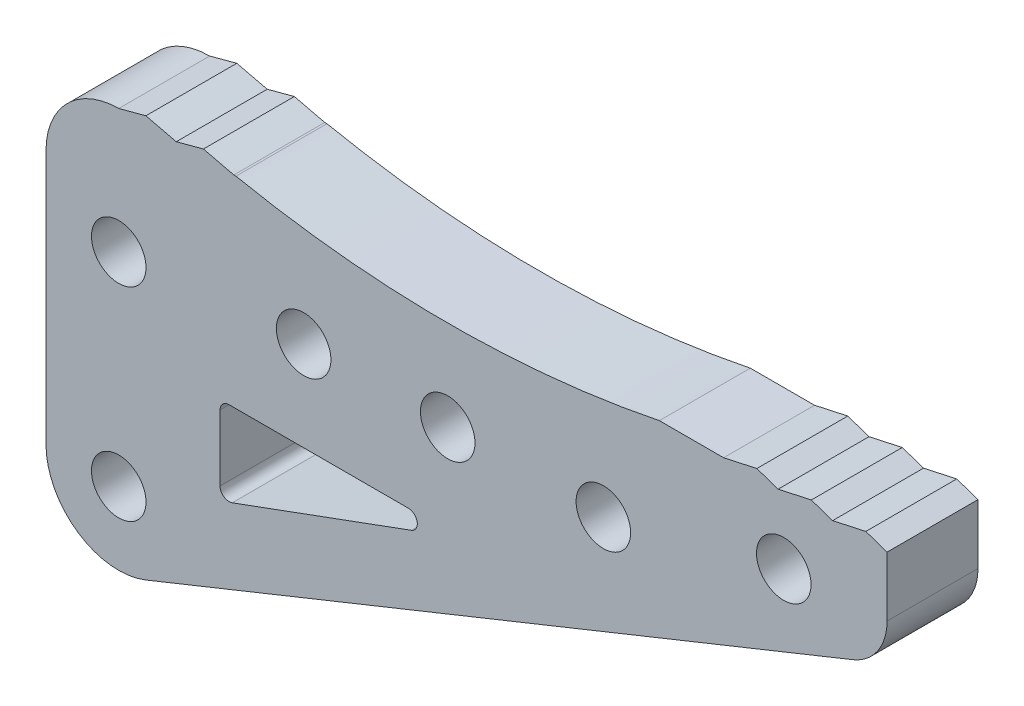
ISO-10303-21;
HEADER;
FILE_DESCRIPTION(('STEP AP214'),'2;1');
FILE_NAME('part.step','',(''),(''),'','','');
FILE_SCHEMA(('AUTOMOTIVE_DESIGN { 1 0 10303 214 1 1 1 1 }'));
ENDSEC;
DATA;
#1=APPLICATION_CONTEXT('core data for automotive mechanical design processes');
#2=APPLICATION_PROTOCOL_DEFINITION('international standard','automotive_design',2000,#1);
#3=PRODUCT_CONTEXT('',#1,'mechanical');
#4=PRODUCT('Part','Part','',(#3));
#5=PRODUCT_RELATED_PRODUCT_CATEGORY('part','',(#4));
#6=PRODUCT_DEFINITION_FORMATION('','',#4);
#7=PRODUCT_DEFINITION_CONTEXT('part definition',#1,'design');
#8=PRODUCT_DEFINITION('design','',#6,#7);
#9=PRODUCT_DEFINITION_SHAPE('','',#8);
#10=(LENGTH_UNIT() NAMED_UNIT(*) SI_UNIT(.MILLI.,.METRE.));
#11=(NAMED_UNIT(*) PLANE_ANGLE_UNIT() SI_UNIT($,.RADIAN.));
#12=(NAMED_UNIT(*) SI_UNIT($,.STERADIAN.) SOLID_ANGLE_UNIT());
#13=UNCERTAINTY_MEASURE_WITH_UNIT(LENGTH_MEASURE(1.E-05),#10,'distance_accuracy_value','');
#14=(GEOMETRIC_REPRESENTATION_CONTEXT(3) GLOBAL_UNCERTAINTY_ASSIGNED_CONTEXT((#13)) GLOBAL_UNIT_ASSIGNED_CONTEXT((#10,
#11,#12)) REPRESENTATION_CONTEXT('',''));
#15=CARTESIAN_POINT('',(0.,0.,0.));
#16=DIRECTION('',(0.,0.,1.));
#17=DIRECTION('',(1.,0.,0.));
#18=AXIS2_PLACEMENT_3D('',#15,#16,#17);
#19=CARTESIAN_POINT('',(104.518408295119,27.7191430019991,5.));
#20=DIRECTION('',(0.,0.,-1.));
#21=DIRECTION('',(-1.,0.,0.));
#22=AXIS2_PLACEMENT_3D('',#19,#20,#21);
#23=CYLINDRICAL_SURFACE('',#22,0.500000000000002);
#24=CARTESIAN_POINT('',(104.518408295119,27.7191430019991,0.));
#25=DIRECTION('',(0.,0.,1.));
#26=DIRECTION('',(1.,0.,0.));
#27=AXIS2_PLACEMENT_3D('',#24,#25,#26);
#28=CIRCLE('',#27,0.500000000000002);
#29=CARTESIAN_POINT('',(104.690751088417,27.2497839053594,0.));
#30=VERTEX_POINT('',#29);
#31=CARTESIAN_POINT('',(104.518408295119,28.2191430019991,0.));
#32=VERTEX_POINT('',#31);
#33=EDGE_CURVE('E317',#30,#32,#28,.T.);
#34=ORIENTED_EDGE('',*,*,#33,.F.);
#35=DIRECTION('',(0.,0.,-1.));
#36=VECTOR('',#35,1.);
#37=CARTESIAN_POINT('',(104.690751088417,27.2497839053594,5.));
#38=LINE('',#37,#36);
#39=CARTESIAN_POINT('',(104.690751088417,27.2497839053594,5.));
#40=VERTEX_POINT('',#39);
#41=EDGE_CURVE('E11',#40,#30,#38,.T.);
#42=ORIENTED_EDGE('',*,*,#41,.F.);
#43=CARTESIAN_POINT('',(104.518408295119,27.7191430019991,5.));
#44=DIRECTION('',(0.,0.,1.));
#45=DIRECTION('',(1.,0.,0.));
#46=AXIS2_PLACEMENT_3D('',#43,#44,#45);
#47=CIRCLE('',#46,0.500000000000002);
#48=CARTESIAN_POINT('',(104.518408295119,28.2191430019991,5.));
#49=VERTEX_POINT('',#48);
#50=EDGE_CURVE('E456',#40,#49,#47,.T.);
#51=ORIENTED_EDGE('',*,*,#50,.T.);
#52=DIRECTION('',(0.,0.,-1.));
#53=VECTOR('',#52,1.);
#54=CARTESIAN_POINT('',(104.518408295119,28.2191430019991,5.));
#55=LINE('',#54,#53);
#56=EDGE_CURVE('E60',#49,#32,#55,.T.);
#57=ORIENTED_EDGE('',*,*,#56,.T.);
#58=EDGE_LOOP('',(#34,#42,#51,#57));
#59=FACE_BOUND('',#58,.T.);
#60=ADVANCED_FACE('F41',(#59),#23,.F.);
#61=CARTESIAN_POINT('',(3.62110305919813,-9.86172748036939,5.));
#62=DIRECTION('',(-0.344685586594792,0.938718193279434,0.));
#63=DIRECTION('',(-0.938718193279434,-0.344685586594792,0.));
#64=AXIS2_PLACEMENT_3D('',#61,#62,#63);
#65=PLANE('',#64);
#66=DIRECTION('',(0.938718193279434,0.344685586594792,0.));
#67=VECTOR('',#66,1.);
#68=CARTESIAN_POINT('',(3.62110305919813,-9.86172748036939,0.));
#69=LINE('',#68,#67);
#70=CARTESIAN_POINT('',(94.8394756659525,23.6325187111732,0.));
#71=VERTEX_POINT('',#70);
#72=EDGE_CURVE('E319',#71,#30,#69,.T.);
#73=ORIENTED_EDGE('',*,*,#72,.F.);
#74=DIRECTION('',(0.,0.,-1.));
#75=VECTOR('',#74,1.);
#76=CARTESIAN_POINT('',(94.8394756659525,23.6325187111732,5.));
#77=LINE('',#76,#75);
#78=CARTESIAN_POINT('',(94.8394756659525,23.6325187111732,5.));
#79=VERTEX_POINT('',#78);
#80=EDGE_CURVE('E51',#79,#71,#77,.T.);
#81=ORIENTED_EDGE('',*,*,#80,.F.);
#82=DIRECTION('',(0.938718193279434,0.344685586594792,0.));
#83=VECTOR('',#82,1.);
#84=CARTESIAN_POINT('',(3.62110305919813,-9.86172748036939,5.));
#85=LINE('',#84,#83);
#86=EDGE_CURVE('E243',#79,#40,#85,.T.);
#87=ORIENTED_EDGE('',*,*,#86,.T.);
#88=ORIENTED_EDGE('',*,*,#41,.T.);
#89=EDGE_LOOP('',(#73,#81,#87,#88));
#90=FACE_BOUND('',#89,.T.);
#91=ADVANCED_FACE('F460',(#90),#65,.T.);
#92=CARTESIAN_POINT('',(94.6671328726551,24.1018778078129,5.));
#93=DIRECTION('',(0.,0.,-1.));
#94=DIRECTION('',(-1.,0.,0.));
#95=AXIS2_PLACEMENT_3D('',#92,#93,#94);
#96=CYLINDRICAL_SURFACE('',#95,0.500000000000002);
#97=CARTESIAN_POINT('',(94.6671328726551,24.1018778078129,0.));
#98=DIRECTION('',(0.,0.,1.));
#99=DIRECTION('',(1.,0.,0.));
#100=AXIS2_PLACEMENT_3D('',#97,#98,#99);
#101=CIRCLE('',#100,0.500000000000002);
#102=CARTESIAN_POINT('',(94.1671328726551,24.1018778078129,0.));
#103=VERTEX_POINT('',#102);
#104=EDGE_CURVE('E322',#71,#103,#101,.F.);
#105=ORIENTED_EDGE('',*,*,#104,.T.);
#106=DIRECTION('',(0.,0.,-1.));
#107=VECTOR('',#106,1.);
#108=CARTESIAN_POINT('',(94.1671328726551,24.1018778078129,5.));
#109=LINE('',#108,#107);
#110=CARTESIAN_POINT('',(94.1671328726551,24.1018778078129,5.));
#111=VERTEX_POINT('',#110);
#112=EDGE_CURVE('E227',#111,#103,#109,.T.);
#113=ORIENTED_EDGE('',*,*,#112,.F.);
#114=CARTESIAN_POINT('',(94.6671328726551,24.1018778078129,5.));
#115=DIRECTION('',(0.,0.,1.));
#116=DIRECTION('',(1.,0.,0.));
#117=AXIS2_PLACEMENT_3D('',#114,#115,#116);
#118=CIRCLE('',#117,0.500000000000002);
#119=EDGE_CURVE('E240',#79,#111,#118,.F.);
#120=ORIENTED_EDGE('',*,*,#119,.F.);
#121=ORIENTED_EDGE('',*,*,#80,.T.);
#122=EDGE_LOOP('',(#105,#113,#120,#121));
#123=FACE_BOUND('',#122,.T.);
#124=ADVANCED_FACE('F465',(#123),#96,.F.);
#125=CARTESIAN_POINT('',(94.1671328726551,0.,5.));
#126=DIRECTION('',(1.,0.,0.));
#127=DIRECTION('',(0.,0.,-1.));
#128=AXIS2_PLACEMENT_3D('',#125,#126,#127);
#129=PLANE('',#128);
#130=DIRECTION('',(0.,-1.,0.));
#131=VECTOR('',#130,1.);
#132=CARTESIAN_POINT('',(94.1671328726551,0.,0.));
#133=LINE('',#132,#131);
#134=CARTESIAN_POINT('',(94.1671328726551,27.7191430019991,0.));
#135=VERTEX_POINT('',#134);
#136=EDGE_CURVE('E224',#135,#103,#133,.T.);
#137=ORIENTED_EDGE('',*,*,#136,.F.);
#138=DIRECTION('',(0.,0.,-1.));
#139=VECTOR('',#138,1.);
#140=CARTESIAN_POINT('',(94.1671328726551,27.7191430019991,5.));
#141=LINE('',#140,#139);
#142=CARTESIAN_POINT('',(94.1671328726551,27.7191430019991,5.));
#143=VERTEX_POINT('',#142);
#144=EDGE_CURVE('E218',#143,#135,#141,.T.);
#145=ORIENTED_EDGE('',*,*,#144,.F.);
#146=DIRECTION('',(0.,-1.,0.));
#147=VECTOR('',#146,1.);
#148=CARTESIAN_POINT('',(94.1671328726551,0.,5.));
#149=LINE('',#148,#147);
#150=EDGE_CURVE('E222',#143,#111,#149,.T.);
#151=ORIENTED_EDGE('',*,*,#150,.T.);
#152=ORIENTED_EDGE('',*,*,#112,.T.);
#153=EDGE_LOOP('',(#137,#145,#151,#152));
#154=FACE_BOUND('',#153,.T.);
#155=ADVANCED_FACE('F220',(#154),#129,.T.);
#156=CARTESIAN_POINT('',(94.6671328726551,27.7191430019991,5.));
#157=DIRECTION('',(0.,0.,-1.));
#158=DIRECTION('',(-1.,0.,0.));
#159=AXIS2_PLACEMENT_3D('',#156,#157,#158);
#160=CYLINDRICAL_SURFACE('',#159,0.5);
#161=CARTESIAN_POINT('',(94.6671328726551,27.7191430019991,0.));
#162=DIRECTION('',(0.,0.,1.));
#163=DIRECTION('',(1.,0.,0.));
#164=AXIS2_PLACEMENT_3D('',#161,#162,#163);
#165=CIRCLE('',#164,0.5);
#166=CARTESIAN_POINT('',(94.6671328726551,28.2191430019991,0.));
#167=VERTEX_POINT('',#166);
#168=EDGE_CURVE('E326',#135,#167,#165,.F.);
#169=ORIENTED_EDGE('',*,*,#168,.T.);
#170=DIRECTION('',(0.,0.,-1.));
#171=VECTOR('',#170,1.);
#172=CARTESIAN_POINT('',(94.6671328726551,28.2191430019991,5.));
#173=LINE('',#172,#171);
#174=CARTESIAN_POINT('',(94.6671328726551,28.2191430019991,5.));
#175=VERTEX_POINT('',#174);
#176=EDGE_CURVE('E137',#175,#167,#173,.T.);
#177=ORIENTED_EDGE('',*,*,#176,.F.);
#178=CARTESIAN_POINT('',(94.6671328726551,27.7191430019991,5.));
#179=DIRECTION('',(0.,0.,1.));
#180=DIRECTION('',(1.,0.,0.));
#181=AXIS2_PLACEMENT_3D('',#178,#179,#180);
#182=CIRCLE('',#181,0.5);
#183=EDGE_CURVE('E229',#143,#175,#182,.F.);
#184=ORIENTED_EDGE('',*,*,#183,.F.);
#185=ORIENTED_EDGE('',*,*,#144,.T.);
#186=EDGE_LOOP('',(#169,#177,#184,#185));
#187=FACE_BOUND('',#186,.T.);
#188=ADVANCED_FACE('F230',(#187),#160,.F.);
#189=CARTESIAN_POINT('',(88.5972714680897,35.2918499194815,5.));
#190=DIRECTION('',(0.,0.,-1.));
#191=DIRECTION('',(-1.,0.,0.));
#192=AXIS2_PLACEMENT_3D('',#189,#190,#191);
#193=CYLINDRICAL_SURFACE('',#192,4.);
#194=CARTESIAN_POINT('',(88.5972714680897,35.2918499194815,0.));
#195=DIRECTION('',(0.,0.,1.));
#196=DIRECTION('',(1.,0.,0.));
#197=AXIS2_PLACEMENT_3D('',#194,#195,#196);
#198=CIRCLE('',#197,4.);
#199=CARTESIAN_POINT('',(88.5972714680898,39.2918499194815,0.));
#200=VERTEX_POINT('',#199);
#201=CARTESIAN_POINT('',(84.5972714680897,35.2918499194815,0.));
#202=VERTEX_POINT('',#201);
#203=EDGE_CURVE('E252',#200,#202,#198,.T.);
#204=ORIENTED_EDGE('',*,*,#203,.T.);
#205=DIRECTION('',(0.,0.,-1.));
#206=VECTOR('',#205,1.);
#207=CARTESIAN_POINT('',(84.5972714680897,35.2918499194815,5.));
#208=LINE('',#207,#206);
#209=CARTESIAN_POINT('',(84.5972714680897,35.2918499194815,5.));
#210=VERTEX_POINT('',#209);
#211=EDGE_CURVE('E45',#210,#202,#208,.T.);
#212=ORIENTED_EDGE('',*,*,#211,.F.);
#213=CARTESIAN_POINT('',(88.5972714680897,35.2918499194815,5.));
#214=DIRECTION('',(0.,0.,1.));
#215=DIRECTION('',(1.,0.,0.));
#216=AXIS2_PLACEMENT_3D('',#213,#214,#215);
#217=CIRCLE('',#216,4.);
#218=CARTESIAN_POINT('',(88.5972714680898,39.2918499194815,5.));
#219=VERTEX_POINT('',#218);
#220=EDGE_CURVE('E150',#219,#210,#217,.T.);
#221=ORIENTED_EDGE('',*,*,#220,.F.);
#222=DIRECTION('',(0.,0.,-1.));
#223=VECTOR('',#222,1.);
#224=CARTESIAN_POINT('',(88.5972714680898,39.2918499194815,5.));
#225=LINE('',#224,#223);
#226=EDGE_CURVE('E251',#219,#200,#225,.T.);
#227=ORIENTED_EDGE('',*,*,#226,.T.);
#228=EDGE_LOOP('',(#204,#212,#221,#227));
#229=FACE_BOUND('',#228,.T.);
#230=ADVANCED_FACE('F43',(#229),#193,.T.);
#231=CARTESIAN_POINT('',(84.5972714680897,0.,5.));
#232=DIRECTION('',(-1.,0.,0.));
#233=DIRECTION('',(0.,0.,1.));
#234=AXIS2_PLACEMENT_3D('',#231,#232,#233);
#235=PLANE('',#234);
#236=DIRECTION('',(0.,1.,0.));
#237=VECTOR('',#236,1.);
#238=CARTESIAN_POINT('',(84.5972714680897,0.,0.));
#239=LINE('',#238,#237);
#240=CARTESIAN_POINT('',(84.5972714680897,21.2918499194815,0.));
#241=VERTEX_POINT('',#240);
#242=EDGE_CURVE('E255',#241,#202,#239,.T.);
#243=ORIENTED_EDGE('',*,*,#242,.F.);
#244=DIRECTION('',(0.,0.,-1.));
#245=VECTOR('',#244,1.);
#246=CARTESIAN_POINT('',(84.5972714680897,21.2918499194815,5.));
#247=LINE('',#246,#245);
#248=CARTESIAN_POINT('',(84.5972714680897,21.2918499194815,5.));
#249=VERTEX_POINT('',#248);
#250=EDGE_CURVE('E375',#249,#241,#247,.T.);
#251=ORIENTED_EDGE('',*,*,#250,.F.);
#252=DIRECTION('',(0.,1.,0.));
#253=VECTOR('',#252,1.);
#254=CARTESIAN_POINT('',(84.5972714680897,0.,5.));
#255=LINE('',#254,#253);
#256=EDGE_CURVE('E383',#249,#210,#255,.T.);
#257=ORIENTED_EDGE('',*,*,#256,.T.);
#258=ORIENTED_EDGE('',*,*,#211,.T.);
#259=EDGE_LOOP('',(#243,#251,#257,#258));
#260=FACE_BOUND('',#259,.T.);
#261=ADVANCED_FACE('F382',(#260),#235,.T.);
#262=CARTESIAN_POINT('',(88.5972714680897,21.2918499194815,5.));
#263=DIRECTION('',(0.,0.,-1.));
#264=DIRECTION('',(-1.,0.,0.));
#265=AXIS2_PLACEMENT_3D('',#262,#263,#264);
#266=CYLINDRICAL_SURFACE('',#265,4.00000000000001);
#267=CARTESIAN_POINT('',(88.5972714680897,21.2918499194815,0.));
#268=DIRECTION('',(0.,0.,1.));
#269=DIRECTION('',(1.,0.,0.));
#270=AXIS2_PLACEMENT_3D('',#267,#268,#269);
#271=CIRCLE('',#270,4.00000000000001);
#272=CARTESIAN_POINT('',(90.0904641295798,17.5810042374742,0.));
#273=VERTEX_POINT('',#272);
#274=EDGE_CURVE('E258',#241,#273,#271,.T.);
#275=ORIENTED_EDGE('',*,*,#274,.T.);
#276=DIRECTION('',(0.,0.,-1.));
#277=VECTOR('',#276,1.);
#278=CARTESIAN_POINT('',(90.0904641295798,17.5810042374742,5.));
#279=LINE('',#278,#277);
#280=CARTESIAN_POINT('',(90.0904641295798,17.5810042374742,5.));
#281=VERTEX_POINT('',#280);
#282=EDGE_CURVE('E374',#281,#273,#279,.T.);
#283=ORIENTED_EDGE('',*,*,#282,.F.);
#284=CARTESIAN_POINT('',(88.5972714680897,21.2918499194815,5.));
#285=DIRECTION('',(0.,0.,1.));
#286=DIRECTION('',(1.,0.,0.));
#287=AXIS2_PLACEMENT_3D('',#284,#285,#286);
#288=CIRCLE('',#287,4.00000000000001);
#289=EDGE_CURVE('E395',#249,#281,#288,.T.);
#290=ORIENTED_EDGE('',*,*,#289,.F.);
#291=ORIENTED_EDGE('',*,*,#250,.T.);
#292=EDGE_LOOP('',(#275,#283,#290,#291));
#293=FACE_BOUND('',#292,.T.);
#294=ADVANCED_FACE('F393',(#293),#266,.T.);
#295=CARTESIAN_POINT('',(6.46571332296763,-16.0684317465694,5.));
#296=DIRECTION('',(0.373298165372517,-0.927711420501824,0.));
#297=DIRECTION('',(0.927711420501824,0.373298165372517,0.));
#298=AXIS2_PLACEMENT_3D('',#295,#296,#297);
#299=PLANE('',#298);
#300=DIRECTION('',(-0.927711420501824,-0.373298165372517,0.));
#301=VECTOR('',#300,1.);
#302=CARTESIAN_POINT('',(6.46571332296763,-16.0684317465694,0.));
#303=LINE('',#302,#301);
#304=CARTESIAN_POINT('',(128.971852367475,33.2263337824007,0.));
#305=VERTEX_POINT('',#304);
#306=EDGE_CURVE('E261',#305,#273,#303,.T.);
#307=ORIENTED_EDGE('',*,*,#306,.F.);
#308=DIRECTION('',(0.,0.,-1.));
#309=VECTOR('',#308,1.);
#310=CARTESIAN_POINT('',(128.971852367475,33.2263337824007,5.));
#311=LINE('',#310,#309);
#312=CARTESIAN_POINT('',(128.971852367475,33.2263337824007,5.));
#313=VERTEX_POINT('',#312);
#314=EDGE_CURVE('E372',#313,#305,#311,.T.);
#315=ORIENTED_EDGE('',*,*,#314,.F.);
#316=DIRECTION('',(-0.927711420501824,-0.373298165372517,0.));
#317=VECTOR('',#316,1.);
#318=CARTESIAN_POINT('',(6.46571332296763,-16.0684317465694,5.));
#319=LINE('',#318,#317);
#320=EDGE_CURVE('E398',#313,#281,#319,.T.);
#321=ORIENTED_EDGE('',*,*,#320,.T.);
#322=ORIENTED_EDGE('',*,*,#282,.T.);
#323=EDGE_LOOP('',(#307,#315,#321,#322));
#324=FACE_BOUND('',#323,.T.);
#325=ADVANCED_FACE('F399',(#324),#299,.T.);
#326=CARTESIAN_POINT('',(127.851957871358,36.0094680439062,5.));
#327=DIRECTION('',(0.,0.,-1.));
#328=DIRECTION('',(-1.,0.,0.));
#329=AXIS2_PLACEMENT_3D('',#326,#327,#328);
#330=CYLINDRICAL_SURFACE('',#329,3.);
#331=CARTESIAN_POINT('',(127.851957871358,36.0094680439062,0.));
#332=DIRECTION('',(0.,0.,1.));
#333=DIRECTION('',(1.,0.,0.));
#334=AXIS2_PLACEMENT_3D('',#331,#332,#333);
#335=CIRCLE('',#334,3.);
#336=CARTESIAN_POINT('',(130.851957871358,36.0094680439062,0.));
#337=VERTEX_POINT('',#336);
#338=EDGE_CURVE('E264',#305,#337,#335,.T.);
#339=ORIENTED_EDGE('',*,*,#338,.T.);
#340=DIRECTION('',(0.,0.,-1.));
#341=VECTOR('',#340,1.);
#342=CARTESIAN_POINT('',(130.851957871358,36.0094680439062,5.));
#343=LINE('',#342,#341);
#344=CARTESIAN_POINT('',(130.851957871358,36.0094680439062,5.));
#345=VERTEX_POINT('',#344);
#346=EDGE_CURVE('E370',#345,#337,#343,.T.);
#347=ORIENTED_EDGE('',*,*,#346,.F.);
#348=CARTESIAN_POINT('',(127.851957871358,36.0094680439062,5.));
#349=DIRECTION('',(0.,0.,1.));
#350=DIRECTION('',(1.,0.,0.));
#351=AXIS2_PLACEMENT_3D('',#348,#349,#350);
#352=CIRCLE('',#351,3.);
#353=EDGE_CURVE('E401',#313,#345,#352,.T.);
#354=ORIENTED_EDGE('',*,*,#353,.F.);
#355=ORIENTED_EDGE('',*,*,#314,.T.);
#356=EDGE_LOOP('',(#339,#347,#354,#355));
#357=FACE_BOUND('',#356,.T.);
#358=ADVANCED_FACE('F553',(#357),#330,.T.);
#359=CARTESIAN_POINT('',(130.851957871357,-1.10647436795116E-12,5.));
#360=DIRECTION('',(1.,0.,0.));
#361=DIRECTION('',(0.,1.,0.));
#362=AXIS2_PLACEMENT_3D('',#359,#360,#361);
#363=PLANE('',#362);
#364=DIRECTION('',(0.,-1.,0.));
#365=VECTOR('',#364,1.);
#366=CARTESIAN_POINT('',(130.851957871357,-1.10647436795116E-12,0.));
#367=LINE('',#366,#365);
#368=CARTESIAN_POINT('',(130.851957871358,39.2918499194815,0.));
#369=VERTEX_POINT('',#368);
#370=EDGE_CURVE('E267',#369,#337,#367,.T.);
#371=ORIENTED_EDGE('',*,*,#370,.F.);
#372=DIRECTION('',(0.,0.,-1.));
#373=VECTOR('',#372,1.);
#374=CARTESIAN_POINT('',(130.851957871358,39.2918499194815,5.));
#375=LINE('',#374,#373);
#376=CARTESIAN_POINT('',(130.851957871358,39.2918499194815,5.));
#377=VERTEX_POINT('',#376);
#378=EDGE_CURVE('E368',#377,#369,#375,.T.);
#379=ORIENTED_EDGE('',*,*,#378,.F.);
#380=DIRECTION('',(0.,-1.,0.));
#381=VECTOR('',#380,1.);
#382=CARTESIAN_POINT('',(130.851957871357,-1.10647436795116E-12,5.));
#383=LINE('',#382,#381);
#384=EDGE_CURVE('E403',#377,#345,#383,.T.);
#385=ORIENTED_EDGE('',*,*,#384,.T.);
#386=ORIENTED_EDGE('',*,*,#346,.T.);
#387=EDGE_LOOP('',(#371,#379,#385,#386));
#388=FACE_BOUND('',#387,.T.);
#389=ADVANCED_FACE('F549',(#388),#363,.T.);
#390=CARTESIAN_POINT('',(25.7621159541442,75.2633598214611,5.));
#391=DIRECTION('',(-0.32384662495724,-0.946109593812368,0.));
#392=DIRECTION('',(0.946109593812368,-0.32384662495724,0.));
#393=AXIS2_PLACEMENT_3D('',#390,#391,#392);
#394=PLANE('',#393);
#395=DIRECTION('',(-0.946109593812368,0.32384662495724,0.));
#396=VECTOR('',#395,1.);
#397=CARTESIAN_POINT('',(25.7621159541442,75.2633598214611,0.));
#398=LINE('',#397,#396);
#399=CARTESIAN_POINT('',(129.683368149063,39.6918499194815,0.));
#400=VERTEX_POINT('',#399);
#401=EDGE_CURVE('E270',#369,#400,#398,.T.);
#402=ORIENTED_EDGE('',*,*,#401,.T.);
#403=DIRECTION('',(0.,0.,-1.));
#404=VECTOR('',#403,1.);
#405=CARTESIAN_POINT('',(129.683368149063,39.6918499194815,5.));
#406=LINE('',#405,#404);
#407=CARTESIAN_POINT('',(129.683368149063,39.6918499194815,5.));
#408=VERTEX_POINT('',#407);
#409=EDGE_CURVE('E365',#408,#400,#406,.T.);
#410=ORIENTED_EDGE('',*,*,#409,.F.);
#411=DIRECTION('',(-0.946109593812368,0.32384662495724,0.));
#412=VECTOR('',#411,1.);
#413=CARTESIAN_POINT('',(25.7621159541442,75.2633598214611,5.));
#414=LINE('',#413,#412);
#415=EDGE_CURVE('E410',#377,#408,#414,.T.);
#416=ORIENTED_EDGE('',*,*,#415,.F.);
#417=ORIENTED_EDGE('',*,*,#378,.T.);
#418=EDGE_LOOP('',(#402,#410,#416,#417));
#419=FACE_BOUND('',#418,.T.);
#420=ADVANCED_FACE('F545',(#419),#394,.F.);
#421=CARTESIAN_POINT('',(-2.36259318148813,10.7966239024737,5.));
#422=DIRECTION('',(0.213768694617668,-0.976884304921242,0.));
#423=DIRECTION('',(0.976884304921242,0.213768694617668,0.));
#424=AXIS2_PLACEMENT_3D('',#421,#422,#423);
#425=PLANE('',#424);
#426=DIRECTION('',(-0.976884304921242,-0.213768694617668,0.));
#427=VECTOR('',#426,1.);
#428=CARTESIAN_POINT('',(-2.36259318148813,10.7966239024737,0.));
#429=LINE('',#428,#427);
#430=CARTESIAN_POINT('',(127.855440431829,39.2918499194815,0.));
#431=VERTEX_POINT('',#430);
#432=EDGE_CURVE('E272',#400,#431,#429,.T.);
#433=ORIENTED_EDGE('',*,*,#432,.T.);
#434=DIRECTION('',(0.,0.,-1.));
#435=VECTOR('',#434,1.);
#436=CARTESIAN_POINT('',(127.855440431829,39.2918499194815,5.));
#437=LINE('',#436,#435);
#438=CARTESIAN_POINT('',(127.855440431829,39.2918499194815,5.));
#439=VERTEX_POINT('',#438);
#440=EDGE_CURVE('E362',#439,#431,#437,.T.);
#441=ORIENTED_EDGE('',*,*,#440,.F.);
#442=DIRECTION('',(-0.976884304921242,-0.213768694617668,0.));
#443=VECTOR('',#442,1.);
#444=CARTESIAN_POINT('',(-2.36259318148813,10.7966239024737,5.));
#445=LINE('',#444,#443);
#446=EDGE_CURVE('E412',#408,#439,#445,.T.);
#447=ORIENTED_EDGE('',*,*,#446,.F.);
#448=ORIENTED_EDGE('',*,*,#409,.T.);
#449=EDGE_LOOP('',(#433,#441,#447,#448));
#450=FACE_BOUND('',#449,.T.);
#451=ADVANCED_FACE('F541',(#450),#425,.F.);
#452=CARTESIAN_POINT('',(25.4478512838843,74.3452436620956,5.));
#453=DIRECTION('',(-0.32384662495724,-0.946109593812368,0.));
#454=DIRECTION('',(0.946109593812368,-0.32384662495724,0.));
#455=AXIS2_PLACEMENT_3D('',#452,#453,#454);
#456=PLANE('',#455);
#457=DIRECTION('',(-0.946109593812368,0.32384662495724,0.));
#458=VECTOR('',#457,1.);
#459=CARTESIAN_POINT('',(25.4478512838843,74.3452436620956,0.));
#460=LINE('',#459,#458);
#461=CARTESIAN_POINT('',(126.686850709534,39.6918499194815,0.));
#462=VERTEX_POINT('',#461);
#463=EDGE_CURVE('E274',#431,#462,#460,.T.);
#464=ORIENTED_EDGE('',*,*,#463,.T.);
#465=DIRECTION('',(0.,0.,-1.));
#466=VECTOR('',#465,1.);
#467=CARTESIAN_POINT('',(126.686850709534,39.6918499194815,5.));
#468=LINE('',#467,#466);
#469=CARTESIAN_POINT('',(126.686850709534,39.6918499194815,5.));
#470=VERTEX_POINT('',#469);
#471=EDGE_CURVE('E359',#470,#462,#468,.T.);
#472=ORIENTED_EDGE('',*,*,#471,.F.);
#473=DIRECTION('',(-0.946109593812368,0.32384662495724,0.));
#474=VECTOR('',#473,1.);
#475=CARTESIAN_POINT('',(25.4478512838843,74.3452436620956,5.));
#476=LINE('',#475,#474);
#477=EDGE_CURVE('E414',#439,#470,#476,.T.);
#478=ORIENTED_EDGE('',*,*,#477,.F.);
#479=ORIENTED_EDGE('',*,*,#440,.T.);
#480=EDGE_LOOP('',(#464,#472,#478,#479));
#481=FACE_BOUND('',#480,.T.);
#482=ADVANCED_FACE('F537',(#481),#456,.F.);
#483=CARTESIAN_POINT('',(-2.49952520312706,11.4223784968002,5.));
#484=DIRECTION('',(0.213768694617668,-0.976884304921242,0.));
#485=DIRECTION('',(0.976884304921242,0.213768694617668,0.));
#486=AXIS2_PLACEMENT_3D('',#483,#484,#485);
#487=PLANE('',#486);
#488=DIRECTION('',(-0.976884304921242,-0.213768694617668,0.));
#489=VECTOR('',#488,1.);
#490=CARTESIAN_POINT('',(-2.49952520312706,11.4223784968002,0.));
#491=LINE('',#490,#489);
#492=CARTESIAN_POINT('',(124.8589229923,39.2918499194815,0.));
#493=VERTEX_POINT('',#492);
#494=EDGE_CURVE('E276',#462,#493,#491,.T.);
#495=ORIENTED_EDGE('',*,*,#494,.T.);
#496=DIRECTION('',(0.,0.,-1.));
#497=VECTOR('',#496,1.);
#498=CARTESIAN_POINT('',(124.8589229923,39.2918499194815,5.));
#499=LINE('',#498,#497);
#500=CARTESIAN_POINT('',(124.8589229923,39.2918499194815,5.));
#501=VERTEX_POINT('',#500);
#502=EDGE_CURVE('E356',#501,#493,#499,.T.);
#503=ORIENTED_EDGE('',*,*,#502,.F.);
#504=DIRECTION('',(-0.976884304921242,-0.213768694617668,0.));
#505=VECTOR('',#504,1.);
#506=CARTESIAN_POINT('',(-2.49952520312706,11.4223784968002,5.));
#507=LINE('',#506,#505);
#508=EDGE_CURVE('E416',#470,#501,#507,.T.);
#509=ORIENTED_EDGE('',*,*,#508,.F.);
#510=ORIENTED_EDGE('',*,*,#471,.T.);
#511=EDGE_LOOP('',(#495,#503,#509,#510));
#512=FACE_BOUND('',#511,.T.);
#513=ADVANCED_FACE('F533',(#512),#487,.F.);
#514=CARTESIAN_POINT('',(25.1335866136243,73.42712750273,5.));
#515=DIRECTION('',(-0.32384662495724,-0.946109593812368,0.));
#516=DIRECTION('',(0.946109593812368,-0.32384662495724,0.));
#517=AXIS2_PLACEMENT_3D('',#514,#515,#516);
#518=PLANE('',#517);
#519=DIRECTION('',(-0.946109593812368,0.32384662495724,0.));
#520=VECTOR('',#519,1.);
#521=CARTESIAN_POINT('',(25.1335866136243,73.42712750273,0.));
#522=LINE('',#521,#520);
#523=CARTESIAN_POINT('',(123.690333270005,39.6918499194815,0.));
#524=VERTEX_POINT('',#523);
#525=EDGE_CURVE('E278',#493,#524,#522,.T.);
#526=ORIENTED_EDGE('',*,*,#525,.T.);
#527=DIRECTION('',(0.,0.,-1.));
#528=VECTOR('',#527,1.);
#529=CARTESIAN_POINT('',(123.690333270005,39.6918499194815,5.));
#530=LINE('',#529,#528);
#531=CARTESIAN_POINT('',(123.690333270005,39.6918499194815,5.));
#532=VERTEX_POINT('',#531);
#533=EDGE_CURVE('E353',#532,#524,#530,.T.);
#534=ORIENTED_EDGE('',*,*,#533,.F.);
#535=DIRECTION('',(-0.946109593812368,0.32384662495724,0.));
#536=VECTOR('',#535,1.);
#537=CARTESIAN_POINT('',(25.1335866136243,73.42712750273,5.));
#538=LINE('',#537,#536);
#539=EDGE_CURVE('E418',#501,#532,#538,.T.);
#540=ORIENTED_EDGE('',*,*,#539,.F.);
#541=ORIENTED_EDGE('',*,*,#502,.T.);
#542=EDGE_LOOP('',(#526,#534,#540,#541));
#543=FACE_BOUND('',#542,.T.);
#544=ADVANCED_FACE('F529',(#543),#518,.F.);
#545=CARTESIAN_POINT('',(-2.63645722476599,12.0481330911268,5.));
#546=DIRECTION('',(0.213768694617668,-0.976884304921242,0.));
#547=DIRECTION('',(0.976884304921242,0.213768694617668,0.));
#548=AXIS2_PLACEMENT_3D('',#545,#546,#547);
#549=PLANE('',#548);
#550=DIRECTION('',(-0.976884304921242,-0.213768694617668,0.));
#551=VECTOR('',#550,1.);
#552=CARTESIAN_POINT('',(-2.63645722476599,12.0481330911268,0.));
#553=LINE('',#552,#551);
#554=CARTESIAN_POINT('',(121.862405552772,39.2918499194815,0.));
#555=VERTEX_POINT('',#554);
#556=EDGE_CURVE('E280',#524,#555,#553,.T.);
#557=ORIENTED_EDGE('',*,*,#556,.T.);
#558=DIRECTION('',(0.,0.,-1.));
#559=VECTOR('',#558,1.);
#560=CARTESIAN_POINT('',(121.862405552772,39.2918499194815,5.));
#561=LINE('',#560,#559);
#562=CARTESIAN_POINT('',(121.862405552772,39.2918499194815,5.));
#563=VERTEX_POINT('',#562);
#564=EDGE_CURVE('E351',#563,#555,#561,.T.);
#565=ORIENTED_EDGE('',*,*,#564,.F.);
#566=DIRECTION('',(-0.976884304921242,-0.213768694617668,0.));
#567=VECTOR('',#566,1.);
#568=CARTESIAN_POINT('',(-2.63645722476599,12.0481330911268,5.));
#569=LINE('',#568,#567);
#570=EDGE_CURVE('E420',#532,#563,#569,.T.);
#571=ORIENTED_EDGE('',*,*,#570,.F.);
#572=ORIENTED_EDGE('',*,*,#533,.T.);
#573=EDGE_LOOP('',(#557,#565,#571,#572));
#574=FACE_BOUND('',#573,.T.);
#575=ADVANCED_FACE('F526',(#574),#549,.F.);
#576=CARTESIAN_POINT('',(0.,39.2918499194815,5.));
#577=DIRECTION('',(0.,1.,0.));
#578=DIRECTION('',(0.,0.,1.));
#579=AXIS2_PLACEMENT_3D('',#576,#577,#578);
#580=PLANE('',#579);
#581=DIRECTION('',(1.,0.,0.));
#582=VECTOR('',#581,1.);
#583=CARTESIAN_POINT('',(0.,39.2918499194815,0.));
#584=LINE('',#583,#582);
#585=CARTESIAN_POINT('',(118.330499071538,39.2918499194815,0.));
#586=VERTEX_POINT('',#585);
#587=EDGE_CURVE('E283',#586,#555,#584,.T.);
#588=ORIENTED_EDGE('',*,*,#587,.F.);
#589=DIRECTION('',(0.,0.,-1.));
#590=VECTOR('',#589,1.);
#591=CARTESIAN_POINT('',(118.330499071538,39.2918499194815,5.));
#592=LINE('',#591,#590);
#593=CARTESIAN_POINT('',(118.330499071538,39.2918499194815,5.));
#594=VERTEX_POINT('',#593);
#595=EDGE_CURVE('E349',#594,#586,#592,.T.);
#596=ORIENTED_EDGE('',*,*,#595,.F.);
#597=DIRECTION('',(1.,0.,0.));
#598=VECTOR('',#597,1.);
#599=CARTESIAN_POINT('',(0.,39.2918499194815,5.));
#600=LINE('',#599,#598);
#601=EDGE_CURVE('E422',#594,#563,#600,.T.);
#602=ORIENTED_EDGE('',*,*,#601,.T.);
#603=ORIENTED_EDGE('',*,*,#564,.T.);
#604=EDGE_LOOP('',(#588,#596,#602,#603));
#605=FACE_BOUND('',#604,.T.);
#606=ADVANCED_FACE('F522',(#605),#580,.T.);
#607=CARTESIAN_POINT('',(106.688669100133,96.4533198101909,5.));
#608=DIRECTION('',(0.,0.,-1.));
#609=DIRECTION('',(-1.,0.,0.));
#610=AXIS2_PLACEMENT_3D('',#607,#608,#609);
#611=CYLINDRICAL_SURFACE('',#610,58.3349453171045);
#612=CARTESIAN_POINT('',(106.688669100133,96.4533198101909,0.));
#613=DIRECTION('',(0.,0.,1.));
#614=DIRECTION('',(1.,0.,0.));
#615=AXIS2_PLACEMENT_3D('',#612,#613,#614);
#616=CIRCLE('',#615,58.3349453171045);
#617=CARTESIAN_POINT('',(95.0468391287285,39.2918499194815,0.));
#618=VERTEX_POINT('',#617);
#619=EDGE_CURVE('E286',#618,#586,#616,.T.);
#620=ORIENTED_EDGE('',*,*,#619,.F.);
#621=DIRECTION('',(0.,0.,-1.));
#622=VECTOR('',#621,1.);
#623=CARTESIAN_POINT('',(95.0468391287285,39.2918499194815,5.));
#624=LINE('',#623,#622);
#625=CARTESIAN_POINT('',(95.0468391287285,39.2918499194815,5.));
#626=VERTEX_POINT('',#625);
#627=EDGE_CURVE('E347',#626,#618,#624,.T.);
#628=ORIENTED_EDGE('',*,*,#627,.F.);
#629=CARTESIAN_POINT('',(106.688669100133,96.4533198101909,5.));
#630=DIRECTION('',(0.,0.,1.));
#631=DIRECTION('',(1.,0.,0.));
#632=AXIS2_PLACEMENT_3D('',#629,#630,#631);
#633=CIRCLE('',#632,58.3349453171045);
#634=EDGE_CURVE('E425',#626,#594,#633,.T.);
#635=ORIENTED_EDGE('',*,*,#634,.T.);
#636=ORIENTED_EDGE('',*,*,#595,.T.);
#637=EDGE_LOOP('',(#620,#628,#635,#636));
#638=FACE_BOUND('',#637,.T.);
#639=ADVANCED_FACE('F520',(#638),#611,.F.);
#640=CARTESIAN_POINT('',(94.9262337759592,39.2918499194815,0.));
#641=VERTEX_POINT('',#640);
#642=EDGE_CURVE('E287',#641,#618,#584,.T.);
#643=ORIENTED_EDGE('',*,*,#642,.F.);
#644=DIRECTION('',(0.,0.,-1.));
#645=VECTOR('',#644,1.);
#646=CARTESIAN_POINT('',(94.9262337759592,39.2918499194815,5.));
#647=LINE('',#646,#645);
#648=CARTESIAN_POINT('',(94.9262337759592,39.2918499194815,5.));
#649=VERTEX_POINT('',#648);
#650=EDGE_CURVE('E345',#649,#641,#647,.T.);
#651=ORIENTED_EDGE('',*,*,#650,.F.);
#652=EDGE_CURVE('E426',#649,#626,#600,.T.);
#653=ORIENTED_EDGE('',*,*,#652,.T.);
#654=ORIENTED_EDGE('',*,*,#627,.T.);
#655=EDGE_LOOP('',(#643,#651,#653,#654));
#656=FACE_BOUND('',#655,.T.);
#657=ADVANCED_FACE('F516',(#656),#580,.T.);
#658=CARTESIAN_POINT('',(14.0374274366176,58.6514773458676,5.));
#659=DIRECTION('',(0.232762587977146,0.972533586894654,0.));
#660=DIRECTION('',(-0.972533586894654,0.232762587977146,0.));
#661=AXIS2_PLACEMENT_3D('',#658,#659,#660);
#662=PLANE('',#661);
#663=DIRECTION('',(0.972533586894654,-0.232762587977146,0.));
#664=VECTOR('',#663,1.);
#665=CARTESIAN_POINT('',(14.0374274366176,58.6514773458676,0.));
#666=LINE('',#665,#664);
#667=CARTESIAN_POINT('',(93.2549452835145,39.6918499194815,0.));
#668=VERTEX_POINT('',#667);
#669=EDGE_CURVE('E290',#668,#641,#666,.T.);
#670=ORIENTED_EDGE('',*,*,#669,.F.);
#671=DIRECTION('',(0.,0.,-1.));
#672=VECTOR('',#671,1.);
#673=CARTESIAN_POINT('',(93.2549452835145,39.6918499194815,5.));
#674=LINE('',#673,#672);
#675=CARTESIAN_POINT('',(93.2549452835145,39.6918499194815,5.));
#676=VERTEX_POINT('',#675);
#677=EDGE_CURVE('E343',#676,#668,#674,.T.);
#678=ORIENTED_EDGE('',*,*,#677,.F.);
#679=DIRECTION('',(0.972533586894654,-0.232762587977146,0.));
#680=VECTOR('',#679,1.);
#681=CARTESIAN_POINT('',(14.0374274366176,58.6514773458676,5.));
#682=LINE('',#681,#680);
#683=EDGE_CURVE('E429',#676,#649,#682,.T.);
#684=ORIENTED_EDGE('',*,*,#683,.T.);
#685=ORIENTED_EDGE('',*,*,#650,.T.);
#686=EDGE_LOOP('',(#670,#678,#684,#685));
#687=FACE_BOUND('',#686,.T.);
#688=ADVANCED_FACE('F512',(#687),#662,.T.);
#689=CARTESIAN_POINT('',(-3.67682914568717,13.7255357447319,5.));
#690=DIRECTION('',(-0.258758828434386,0.965941959284958,0.));
#691=DIRECTION('',(-0.965941959284958,-0.258758828434386,0.));
#692=AXIS2_PLACEMENT_3D('',#689,#690,#691);
#693=PLANE('',#692);
#694=DIRECTION('',(0.965941959284958,0.258758828434386,0.));
#695=VECTOR('',#694,1.);
#696=CARTESIAN_POINT('',(-3.67682914568717,13.7255357447319,0.));
#697=LINE('',#696,#695);
#698=CARTESIAN_POINT('',(91.7617526220245,39.2918499194815,0.));
#699=VERTEX_POINT('',#698);
#700=EDGE_CURVE('E293',#699,#668,#697,.T.);
#701=ORIENTED_EDGE('',*,*,#700,.F.);
#702=DIRECTION('',(0.,0.,-1.));
#703=VECTOR('',#702,1.);
#704=CARTESIAN_POINT('',(91.7617526220245,39.2918499194815,5.));
#705=LINE('',#704,#703);
#706=CARTESIAN_POINT('',(91.7617526220245,39.2918499194815,5.));
#707=VERTEX_POINT('',#706);
#708=EDGE_CURVE('E341',#707,#699,#705,.T.);
#709=ORIENTED_EDGE('',*,*,#708,.F.);
#710=DIRECTION('',(0.965941959284958,0.258758828434386,0.));
#711=VECTOR('',#710,1.);
#712=CARTESIAN_POINT('',(-3.67682914568717,13.7255357447319,5.));
#713=LINE('',#712,#711);
#714=EDGE_CURVE('E432',#707,#676,#713,.T.);
#715=ORIENTED_EDGE('',*,*,#714,.T.);
#716=ORIENTED_EDGE('',*,*,#677,.T.);
#717=EDGE_LOOP('',(#701,#709,#715,#716));
#718=FACE_BOUND('',#717,.T.);
#719=ADVANCED_FACE('F508',(#718),#693,.T.);
#720=CARTESIAN_POINT('',(13.8659808401037,57.9351355363114,5.));
#721=DIRECTION('',(0.232762587977146,0.972533586894654,0.));
#722=DIRECTION('',(-0.972533586894654,0.232762587977146,0.));
#723=AXIS2_PLACEMENT_3D('',#720,#721,#722);
#724=PLANE('',#723);
#725=DIRECTION('',(0.972533586894654,-0.232762587977146,0.));
#726=VECTOR('',#725,1.);
#727=CARTESIAN_POINT('',(13.8659808401037,57.9351355363114,0.));
#728=LINE('',#727,#726);
#729=CARTESIAN_POINT('',(90.0904641295798,39.6918499194815,0.));
#730=VERTEX_POINT('',#729);
#731=EDGE_CURVE('E296',#730,#699,#728,.T.);
#732=ORIENTED_EDGE('',*,*,#731,.F.);
#733=DIRECTION('',(0.,0.,-1.));
#734=VECTOR('',#733,1.);
#735=CARTESIAN_POINT('',(90.0904641295798,39.6918499194815,5.));
#736=LINE('',#735,#734);
#737=CARTESIAN_POINT('',(90.0904641295798,39.6918499194815,5.));
#738=VERTEX_POINT('',#737);
#739=EDGE_CURVE('E339',#738,#730,#736,.T.);
#740=ORIENTED_EDGE('',*,*,#739,.F.);
#741=DIRECTION('',(0.972533586894654,-0.232762587977146,0.));
#742=VECTOR('',#741,1.);
#743=CARTESIAN_POINT('',(13.8659808401037,57.9351355363114,5.));
#744=LINE('',#743,#742);
#745=EDGE_CURVE('E435',#738,#707,#744,.T.);
#746=ORIENTED_EDGE('',*,*,#745,.T.);
#747=ORIENTED_EDGE('',*,*,#708,.T.);
#748=EDGE_LOOP('',(#732,#740,#746,#747));
#749=FACE_BOUND('',#748,.T.);
#750=ADVANCED_FACE('F505',(#749),#724,.T.);
#751=CARTESIAN_POINT('',(0.,28.2191430019991,5.));
#752=DIRECTION('',(0.,-1.,0.));
#753=DIRECTION('',(0.,0.,-1.));
#754=AXIS2_PLACEMENT_3D('',#751,#752,#753);
#755=PLANE('',#754);
#756=DIRECTION('',(-1.,0.,0.));
#757=VECTOR('',#756,1.);
#758=CARTESIAN_POINT('',(0.,28.2191430019991,0.));
#759=LINE('',#758,#757);
#760=EDGE_CURVE('E328',#32,#167,#759,.T.);
#761=ORIENTED_EDGE('',*,*,#760,.F.);
#762=ORIENTED_EDGE('',*,*,#56,.F.);
#763=DIRECTION('',(-1.,0.,0.));
#764=VECTOR('',#763,1.);
#765=CARTESIAN_POINT('',(0.,28.2191430019991,5.));
#766=LINE('',#765,#764);
#767=EDGE_CURVE('E233',#49,#175,#766,.T.);
#768=ORIENTED_EDGE('',*,*,#767,.T.);
#769=ORIENTED_EDGE('',*,*,#176,.T.);
#770=EDGE_LOOP('',(#761,#762,#768,#769));
#771=FACE_BOUND('',#770,.T.);
#772=ADVANCED_FACE('F483',(#771),#755,.T.);
#773=CARTESIAN_POINT('',(125.169093905801,35.6496472362141,5.));
#774=DIRECTION('',(0.,0.,-1.));
#775=DIRECTION('',(-1.,0.,0.));
#776=AXIS2_PLACEMENT_3D('',#773,#774,#775);
#777=CYLINDRICAL_SURFACE('',#776,1.5);
#778=CARTESIAN_POINT('',(125.169093905801,35.6496472362141,5.));
#779=DIRECTION('',(0.,0.,1.));
#780=DIRECTION('',(1.,0.,0.));
#781=AXIS2_PLACEMENT_3D('',#778,#779,#780);
#782=CIRCLE('',#781,1.5);
#783=CARTESIAN_POINT('',(126.669093905801,35.6496472362141,5.));
#784=VERTEX_POINT('',#783);
#785=EDGE_CURVE('E453',#784,#784,#782,.T.);
#786=ORIENTED_EDGE('',*,*,#785,.T.);
#787=EDGE_LOOP('',(#786));
#788=FACE_BOUND('',#787,.T.);
#789=CARTESIAN_POINT('',(125.169093905801,35.6496472362141,0.));
#790=DIRECTION('',(0.,0.,1.));
#791=DIRECTION('',(1.,0.,0.));
#792=AXIS2_PLACEMENT_3D('',#789,#790,#791);
#793=CIRCLE('',#792,1.5);
#794=CARTESIAN_POINT('',(126.669093905801,35.6496472362141,0.));
#795=VERTEX_POINT('',#794);
#796=EDGE_CURVE('E314',#795,#795,#793,.T.);
#797=ORIENTED_EDGE('',*,*,#796,.F.);
#798=EDGE_LOOP('',(#797));
#799=FACE_BOUND('',#798,.T.);
#800=ADVANCED_FACE('F479',(#788,#799),#777,.F.);
#801=CARTESIAN_POINT('',(115.248465961861,33.1569152503759,5.));
#802=DIRECTION('',(0.,0.,-1.));
#803=DIRECTION('',(-1.,0.,0.));
#804=AXIS2_PLACEMENT_3D('',#801,#802,#803);
#805=CYLINDRICAL_SURFACE('',#804,1.5);
#806=CARTESIAN_POINT('',(115.248465961861,33.1569152503759,5.));
#807=DIRECTION('',(0.,0.,1.));
#808=DIRECTION('',(1.,0.,0.));
#809=AXIS2_PLACEMENT_3D('',#806,#807,#808);
#810=CIRCLE('',#809,1.5);
#811=CARTESIAN_POINT('',(116.748465961861,33.1569152503759,5.));
#812=VERTEX_POINT('',#811);
#813=EDGE_CURVE('E450',#812,#812,#810,.T.);
#814=ORIENTED_EDGE('',*,*,#813,.T.);
#815=EDGE_LOOP('',(#814));
#816=FACE_BOUND('',#815,.T.);
#817=CARTESIAN_POINT('',(115.248465961861,33.1569152503759,0.));
#818=DIRECTION('',(0.,0.,1.));
#819=DIRECTION('',(1.,0.,0.));
#820=AXIS2_PLACEMENT_3D('',#817,#818,#819);
#821=CIRCLE('',#820,1.5);
#822=CARTESIAN_POINT('',(116.748465961861,33.1569152503759,0.));
#823=VERTEX_POINT('',#822);
#824=EDGE_CURVE('E311',#823,#823,#821,.T.);
#825=ORIENTED_EDGE('',*,*,#824,.F.);
#826=EDGE_LOOP('',(#825));
#827=FACE_BOUND('',#826,.T.);
#828=ADVANCED_FACE('F482',(#816,#827),#805,.F.);
#829=CARTESIAN_POINT('',(106.688669100133,33.1569152503759,5.));
#830=DIRECTION('',(0.,0.,-1.));
#831=DIRECTION('',(-1.,0.,0.));
#832=AXIS2_PLACEMENT_3D('',#829,#830,#831);
#833=CYLINDRICAL_SURFACE('',#832,1.5);
#834=CARTESIAN_POINT('',(106.688669100133,33.1569152503759,5.));
#835=DIRECTION('',(0.,0.,1.));
#836=DIRECTION('',(1.,0.,0.));
#837=AXIS2_PLACEMENT_3D('',#834,#835,#836);
#838=CIRCLE('',#837,1.5);
#839=CARTESIAN_POINT('',(108.188669100133,33.1569152503759,5.));
#840=VERTEX_POINT('',#839);
#841=EDGE_CURVE('E447',#840,#840,#838,.T.);
#842=ORIENTED_EDGE('',*,*,#841,.T.);
#843=EDGE_LOOP('',(#842));
#844=FACE_BOUND('',#843,.T.);
#845=CARTESIAN_POINT('',(106.688669100133,33.1569152503759,0.));
#846=DIRECTION('',(0.,0.,1.));
#847=DIRECTION('',(1.,0.,0.));
#848=AXIS2_PLACEMENT_3D('',#845,#846,#847);
#849=CIRCLE('',#848,1.5);
#850=CARTESIAN_POINT('',(108.188669100133,33.1569152503759,0.));
#851=VERTEX_POINT('',#850);
#852=EDGE_CURVE('E308',#851,#851,#849,.T.);
#853=ORIENTED_EDGE('',*,*,#852,.F.);
#854=EDGE_LOOP('',(#853));
#855=FACE_BOUND('',#854,.T.);
#856=ADVANCED_FACE('F487',(#844,#855),#833,.F.);
#857=CARTESIAN_POINT('',(98.7665053889568,33.1569152503759,5.));
#858=DIRECTION('',(0.,0.,-1.));
#859=DIRECTION('',(-1.,0.,0.));
#860=AXIS2_PLACEMENT_3D('',#857,#858,#859);
#861=CYLINDRICAL_SURFACE('',#860,1.5);
#862=CARTESIAN_POINT('',(98.7665053889568,33.1569152503759,5.));
#863=DIRECTION('',(0.,0.,1.));
#864=DIRECTION('',(1.,0.,0.));
#865=AXIS2_PLACEMENT_3D('',#862,#863,#864);
#866=CIRCLE('',#865,1.5);
#867=CARTESIAN_POINT('',(100.266505388957,33.1569152503759,5.));
#868=VERTEX_POINT('',#867);
#869=EDGE_CURVE('E444',#868,#868,#866,.T.);
#870=ORIENTED_EDGE('',*,*,#869,.T.);
#871=EDGE_LOOP('',(#870));
#872=FACE_BOUND('',#871,.T.);
#873=CARTESIAN_POINT('',(98.7665053889568,33.1569152503759,0.));
#874=DIRECTION('',(0.,0.,1.));
#875=DIRECTION('',(1.,0.,0.));
#876=AXIS2_PLACEMENT_3D('',#873,#874,#875);
#877=CIRCLE('',#876,1.5);
#878=CARTESIAN_POINT('',(100.266505388957,33.1569152503759,0.));
#879=VERTEX_POINT('',#878);
#880=EDGE_CURVE('E305',#879,#879,#877,.T.);
#881=ORIENTED_EDGE('',*,*,#880,.F.);
#882=EDGE_LOOP('',(#881));
#883=FACE_BOUND('',#882,.T.);
#884=ADVANCED_FACE('F491',(#872,#883),#861,.F.);
#885=CARTESIAN_POINT('',(88.5972714680897,32.4608051127484,5.));
#886=DIRECTION('',(0.,0.,-1.));
#887=DIRECTION('',(-1.,0.,0.));
#888=AXIS2_PLACEMENT_3D('',#885,#886,#887);
#889=CYLINDRICAL_SURFACE('',#888,1.5);
#890=CARTESIAN_POINT('',(88.5972714680897,32.4608051127484,5.));
#891=DIRECTION('',(0.,0.,1.));
#892=DIRECTION('',(1.,0.,0.));
#893=AXIS2_PLACEMENT_3D('',#890,#891,#892);
#894=CIRCLE('',#893,1.5);
#895=CARTESIAN_POINT('',(90.0972714680897,32.4608051127484,5.));
#896=VERTEX_POINT('',#895);
#897=EDGE_CURVE('E441',#896,#896,#894,.T.);
#898=ORIENTED_EDGE('',*,*,#897,.T.);
#899=EDGE_LOOP('',(#898));
#900=FACE_BOUND('',#899,.T.);
#901=CARTESIAN_POINT('',(88.5972714680897,32.4608051127484,0.));
#902=DIRECTION('',(0.,0.,1.));
#903=DIRECTION('',(1.,0.,0.));
#904=AXIS2_PLACEMENT_3D('',#901,#902,#903);
#905=CIRCLE('',#904,1.5);
#906=CARTESIAN_POINT('',(90.0972714680897,32.4608051127484,0.));
#907=VERTEX_POINT('',#906);
#908=EDGE_CURVE('E302',#907,#907,#905,.T.);
#909=ORIENTED_EDGE('',*,*,#908,.F.);
#910=EDGE_LOOP('',(#909));
#911=FACE_BOUND('',#910,.T.);
#912=ADVANCED_FACE('F495',(#900,#911),#889,.F.);
#913=CARTESIAN_POINT('',(-3.88871056130337,14.5164851819921,5.));
#914=DIRECTION('',(-0.258758828434391,0.965941959284957,0.));
#915=DIRECTION('',(-0.965941959284957,-0.258758828434391,0.));
#916=AXIS2_PLACEMENT_3D('',#913,#914,#915);
#917=PLANE('',#916);
#918=DIRECTION('',(0.965941959284957,0.258758828434391,0.));
#919=VECTOR('',#918,1.);
#920=CARTESIAN_POINT('',(-3.88871056130337,14.5164851819921,0.));
#921=LINE('',#920,#919);
#922=EDGE_CURVE('E299',#200,#730,#921,.T.);
#923=ORIENTED_EDGE('',*,*,#922,.F.);
#924=ORIENTED_EDGE('',*,*,#226,.F.);
#925=DIRECTION('',(0.965941959284957,0.258758828434391,0.));
#926=VECTOR('',#925,1.);
#927=CARTESIAN_POINT('',(-3.88871056130337,14.5164851819921,5.));
#928=LINE('',#927,#926);
#929=EDGE_CURVE('E438',#219,#738,#928,.T.);
#930=ORIENTED_EDGE('',*,*,#929,.T.);
#931=ORIENTED_EDGE('',*,*,#739,.T.);
#932=EDGE_LOOP('',(#923,#924,#930,#931));
#933=FACE_BOUND('',#932,.T.);
#934=ADVANCED_FACE('F499',(#933),#917,.T.);
#935=CARTESIAN_POINT('',(88.5972714680897,21.2918499194815,5.));
#936=DIRECTION('',(0.,0.,-1.));
#937=DIRECTION('',(-1.,0.,0.));
#938=AXIS2_PLACEMENT_3D('',#935,#936,#937);
#939=CYLINDRICAL_SURFACE('',#938,1.5);
#940=CARTESIAN_POINT('',(88.5972714680897,21.2918499194815,5.));
#941=DIRECTION('',(0.,0.,1.));
#942=DIRECTION('',(1.,0.,0.));
#943=AXIS2_PLACEMENT_3D('',#940,#941,#942);
#944=CIRCLE('',#943,1.5);
#945=CARTESIAN_POINT('',(90.0972714680897,21.2918499194815,5.));
#946=VERTEX_POINT('',#945);
#947=EDGE_CURVE('E248',#946,#946,#944,.T.);
#948=ORIENTED_EDGE('',*,*,#947,.T.);
#949=EDGE_LOOP('',(#948));
#950=FACE_BOUND('',#949,.T.);
#951=CARTESIAN_POINT('',(88.5972714680897,21.2918499194815,0.));
#952=DIRECTION('',(0.,0.,1.));
#953=DIRECTION('',(1.,0.,0.));
#954=AXIS2_PLACEMENT_3D('',#951,#952,#953);
#955=CIRCLE('',#954,1.5);
#956=CARTESIAN_POINT('',(90.0972714680897,21.2918499194815,0.));
#957=VERTEX_POINT('',#956);
#958=EDGE_CURVE('E331',#957,#957,#955,.T.);
#959=ORIENTED_EDGE('',*,*,#958,.F.);
#960=EDGE_LOOP('',(#959));
#961=FACE_BOUND('',#960,.T.);
#962=ADVANCED_FACE('F503',(#950,#961),#939,.F.);
#963=CARTESIAN_POINT('',(0.,0.,5.));
#964=DIRECTION('',(0.,0.,1.));
#965=DIRECTION('',(1.,0.,0.));
#966=AXIS2_PLACEMENT_3D('',#963,#964,#965);
#967=PLANE('',#966);
#968=ORIENTED_EDGE('',*,*,#220,.T.);
#969=ORIENTED_EDGE('',*,*,#256,.F.);
#970=ORIENTED_EDGE('',*,*,#289,.T.);
#971=ORIENTED_EDGE('',*,*,#320,.F.);
#972=ORIENTED_EDGE('',*,*,#353,.T.);
#973=ORIENTED_EDGE('',*,*,#384,.F.);
#974=ORIENTED_EDGE('',*,*,#415,.T.);
#975=ORIENTED_EDGE('',*,*,#446,.T.);
#976=ORIENTED_EDGE('',*,*,#477,.T.);
#977=ORIENTED_EDGE('',*,*,#508,.T.);
#978=ORIENTED_EDGE('',*,*,#539,.T.);
#979=ORIENTED_EDGE('',*,*,#570,.T.);
#980=ORIENTED_EDGE('',*,*,#601,.F.);
#981=ORIENTED_EDGE('',*,*,#634,.F.);
#982=ORIENTED_EDGE('',*,*,#652,.F.);
#983=ORIENTED_EDGE('',*,*,#683,.F.);
#984=ORIENTED_EDGE('',*,*,#714,.F.);
#985=ORIENTED_EDGE('',*,*,#745,.F.);
#986=ORIENTED_EDGE('',*,*,#929,.F.);
#987=EDGE_LOOP('',(#968,#969,#970,#971,#972,#973,#974,#975,#976,#977,#978,#979,#980,#981,#982,
#983,#984,#985,#986));
#988=FACE_BOUND('',#987,.T.);
#989=ORIENTED_EDGE('',*,*,#897,.F.);
#990=EDGE_LOOP('',(#989));
#991=FACE_BOUND('',#990,.T.);
#992=ORIENTED_EDGE('',*,*,#869,.F.);
#993=EDGE_LOOP('',(#992));
#994=FACE_BOUND('',#993,.T.);
#995=ORIENTED_EDGE('',*,*,#841,.F.);
#996=EDGE_LOOP('',(#995));
#997=FACE_BOUND('',#996,.T.);
#998=ORIENTED_EDGE('',*,*,#813,.F.);
#999=EDGE_LOOP('',(#998));
#1000=FACE_BOUND('',#999,.T.);
#1001=ORIENTED_EDGE('',*,*,#785,.F.);
#1002=EDGE_LOOP('',(#1001));
#1003=FACE_BOUND('',#1002,.T.);
#1004=ORIENTED_EDGE('',*,*,#50,.F.);
#1005=ORIENTED_EDGE('',*,*,#86,.F.);
#1006=ORIENTED_EDGE('',*,*,#119,.T.);
#1007=ORIENTED_EDGE('',*,*,#150,.F.);
#1008=ORIENTED_EDGE('',*,*,#183,.T.);
#1009=ORIENTED_EDGE('',*,*,#767,.F.);
#1010=EDGE_LOOP('',(#1004,#1005,#1006,#1007,#1008,#1009));
#1011=FACE_BOUND('',#1010,.T.);
#1012=ORIENTED_EDGE('',*,*,#947,.F.);
#1013=EDGE_LOOP('',(#1012));
#1014=FACE_BOUND('',#1013,.T.);
#1015=ADVANCED_FACE('F236',(#988,#991,#994,#997,#1000,#1003,#1011,#1014),#967,.T.);
#1016=CARTESIAN_POINT('',(0.,0.,0.));
#1017=DIRECTION('',(0.,0.,1.));
#1018=DIRECTION('',(1.,0.,0.));
#1019=AXIS2_PLACEMENT_3D('',#1016,#1017,#1018);
#1020=PLANE('',#1019);
#1021=ORIENTED_EDGE('',*,*,#203,.F.);
#1022=ORIENTED_EDGE('',*,*,#922,.T.);
#1023=ORIENTED_EDGE('',*,*,#731,.T.);
#1024=ORIENTED_EDGE('',*,*,#700,.T.);
#1025=ORIENTED_EDGE('',*,*,#669,.T.);
#1026=ORIENTED_EDGE('',*,*,#642,.T.);
#1027=ORIENTED_EDGE('',*,*,#619,.T.);
#1028=ORIENTED_EDGE('',*,*,#587,.T.);
#1029=ORIENTED_EDGE('',*,*,#556,.F.);
#1030=ORIENTED_EDGE('',*,*,#525,.F.);
#1031=ORIENTED_EDGE('',*,*,#494,.F.);
#1032=ORIENTED_EDGE('',*,*,#463,.F.);
#1033=ORIENTED_EDGE('',*,*,#432,.F.);
#1034=ORIENTED_EDGE('',*,*,#401,.F.);
#1035=ORIENTED_EDGE('',*,*,#370,.T.);
#1036=ORIENTED_EDGE('',*,*,#338,.F.);
#1037=ORIENTED_EDGE('',*,*,#306,.T.);
#1038=ORIENTED_EDGE('',*,*,#274,.F.);
#1039=ORIENTED_EDGE('',*,*,#242,.T.);
#1040=EDGE_LOOP('',(#1021,#1022,#1023,#1024,#1025,#1026,#1027,#1028,#1029,#1030,#1031,#1032,
#1033,#1034,#1035,#1036,#1037,#1038,#1039));
#1041=FACE_BOUND('',#1040,.T.);
#1042=ORIENTED_EDGE('',*,*,#908,.T.);
#1043=EDGE_LOOP('',(#1042));
#1044=FACE_BOUND('',#1043,.T.);
#1045=ORIENTED_EDGE('',*,*,#880,.T.);
#1046=EDGE_LOOP('',(#1045));
#1047=FACE_BOUND('',#1046,.T.);
#1048=ORIENTED_EDGE('',*,*,#852,.T.);
#1049=EDGE_LOOP('',(#1048));
#1050=FACE_BOUND('',#1049,.T.);
#1051=ORIENTED_EDGE('',*,*,#824,.T.);
#1052=EDGE_LOOP('',(#1051));
#1053=FACE_BOUND('',#1052,.T.);
#1054=ORIENTED_EDGE('',*,*,#796,.T.);
#1055=EDGE_LOOP('',(#1054));
#1056=FACE_BOUND('',#1055,.T.);
#1057=ORIENTED_EDGE('',*,*,#33,.T.);
#1058=ORIENTED_EDGE('',*,*,#760,.T.);
#1059=ORIENTED_EDGE('',*,*,#168,.F.);
#1060=ORIENTED_EDGE('',*,*,#136,.T.);
#1061=ORIENTED_EDGE('',*,*,#104,.F.);
#1062=ORIENTED_EDGE('',*,*,#72,.T.);
#1063=EDGE_LOOP('',(#1057,#1058,#1059,#1060,#1061,#1062));
#1064=FACE_BOUND('',#1063,.T.);
#1065=ORIENTED_EDGE('',*,*,#958,.T.);
#1066=EDGE_LOOP('',(#1065));
#1067=FACE_BOUND('',#1066,.T.);
#1068=ADVANCED_FACE('F388',(#1041,#1044,#1047,#1050,#1053,#1056,#1064,#1067),#1020,.F.);
#1069=CLOSED_SHELL('',(#60,#91,#124,#155,#188,#230,#261,#294,#325,#358,#389,#420,#451,#482,#513,
#544,#575,#606,#639,#657,#688,#719,#750,#772,#800,#828,#856,#884,#912,#934,#962,#1015,#1068));
#1070=MANIFOLD_SOLID_BREP('B2',#1069);
#1071=ADVANCED_BREP_SHAPE_REPRESENTATION('',(#18,#1070),#14);
#1072=SHAPE_DEFINITION_REPRESENTATION(#9,#1071);
ENDSEC;
END-ISO-10303-21;
